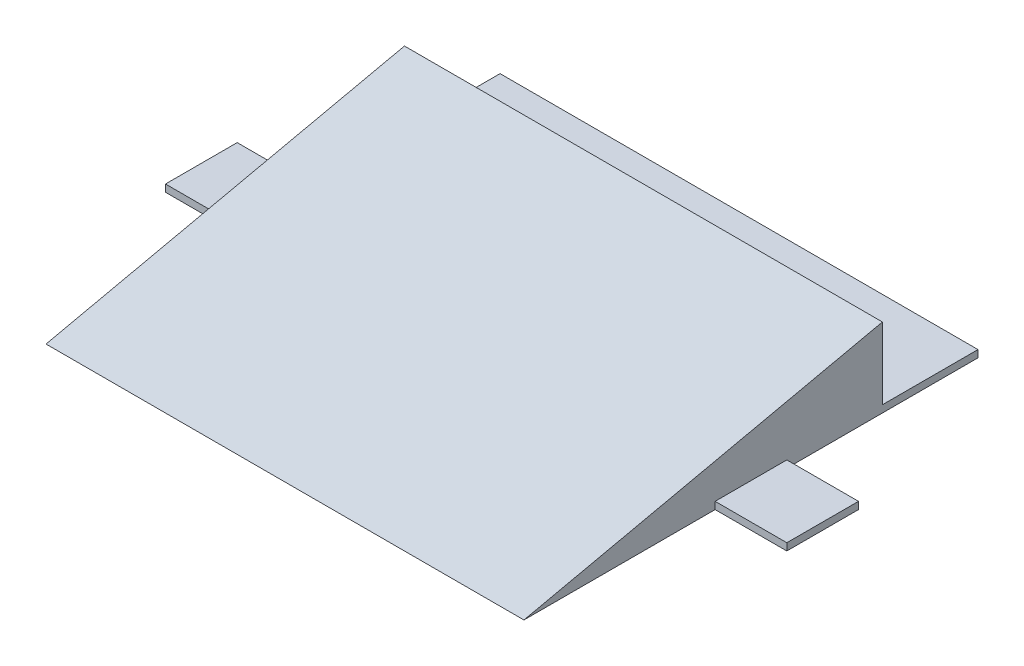
ISO-10303-21;
HEADER;
FILE_DESCRIPTION(('STEP AP214'),'2;1');
FILE_NAME('part.step','',(''),(''),'','','');
FILE_SCHEMA(('AUTOMOTIVE_DESIGN { 1 0 10303 214 1 1 1 1 }'));
ENDSEC;
DATA;
#1=APPLICATION_CONTEXT('core data for automotive mechanical design processes');
#2=APPLICATION_PROTOCOL_DEFINITION('international standard','automotive_design',2000,#1);
#3=PRODUCT_CONTEXT('',#1,'mechanical');
#4=PRODUCT('Part','Part','',(#3));
#5=PRODUCT_RELATED_PRODUCT_CATEGORY('part','',(#4));
#6=PRODUCT_DEFINITION_FORMATION('','',#4);
#7=PRODUCT_DEFINITION_CONTEXT('part definition',#1,'design');
#8=PRODUCT_DEFINITION('design','',#6,#7);
#9=PRODUCT_DEFINITION_SHAPE('','',#8);
#10=(LENGTH_UNIT() NAMED_UNIT(*) SI_UNIT(.MILLI.,.METRE.));
#11=(NAMED_UNIT(*) PLANE_ANGLE_UNIT() SI_UNIT($,.RADIAN.));
#12=(NAMED_UNIT(*) SI_UNIT($,.STERADIAN.) SOLID_ANGLE_UNIT());
#13=UNCERTAINTY_MEASURE_WITH_UNIT(LENGTH_MEASURE(1.E-05),#10,'distance_accuracy_value','');
#14=(GEOMETRIC_REPRESENTATION_CONTEXT(3) GLOBAL_UNCERTAINTY_ASSIGNED_CONTEXT((#13)) GLOBAL_UNIT_ASSIGNED_CONTEXT((#10,
#11,#12)) REPRESENTATION_CONTEXT('',''));
#15=CARTESIAN_POINT('',(0.,0.,0.));
#16=DIRECTION('',(0.,0.,1.));
#17=DIRECTION('',(1.,0.,0.));
#18=AXIS2_PLACEMENT_3D('',#15,#16,#17);
#19=CARTESIAN_POINT('',(-50.,0.,0.));
#20=DIRECTION('',(1.,0.,0.));
#21=DIRECTION('',(0.,0.,-1.));
#22=AXIS2_PLACEMENT_3D('',#19,#20,#21);
#23=PLANE('',#22);
#24=DIRECTION('',(0.,-1.,0.));
#25=VECTOR('',#24,1.);
#26=CARTESIAN_POINT('',(-50.,22.7132034355964,20.));
#27=LINE('',#26,#25);
#28=CARTESIAN_POINT('',(-50.,1.5,20.));
#29=VERTEX_POINT('',#28);
#30=CARTESIAN_POINT('',(-50.,0.,20.));
#31=VERTEX_POINT('',#30);
#32=EDGE_CURVE('E163',#29,#31,#27,.T.);
#33=ORIENTED_EDGE('',*,*,#32,.F.);
#34=DIRECTION('',(0.,0.,1.));
#35=VECTOR('',#34,1.);
#36=CARTESIAN_POINT('',(-50.,1.5,35.));
#37=LINE('',#36,#35);
#38=CARTESIAN_POINT('',(-50.,1.5,35.));
#39=VERTEX_POINT('',#38);
#40=EDGE_CURVE('E145',#29,#39,#37,.T.);
#41=ORIENTED_EDGE('',*,*,#40,.T.);
#42=DIRECTION('',(0.,-1.,0.));
#43=VECTOR('',#42,1.);
#44=CARTESIAN_POINT('',(-50.,22.7132034355964,35.));
#45=LINE('',#44,#43);
#46=CARTESIAN_POINT('',(-50.,0.,35.));
#47=VERTEX_POINT('',#46);
#48=EDGE_CURVE('E154',#39,#47,#45,.T.);
#49=ORIENTED_EDGE('',*,*,#48,.T.);
#50=DIRECTION('',(0.,0.,-1.));
#51=VECTOR('',#50,1.);
#52=CARTESIAN_POINT('',(-50.,0.,0.));
#53=LINE('',#52,#51);
#54=CARTESIAN_POINT('',(-50.,0.,75.));
#55=VERTEX_POINT('',#54);
#56=EDGE_CURVE('E257',#55,#47,#53,.T.);
#57=ORIENTED_EDGE('',*,*,#56,.F.);
#58=DIRECTION('',(0.,-0.21486178267512,0.97664446670509));
#59=VECTOR('',#58,1.);
#60=CARTESIAN_POINT('',(-50.,0.,75.));
#61=LINE('',#60,#59);
#62=CARTESIAN_POINT('',(-50.,16.5,0.));
#63=VERTEX_POINT('',#62);
#64=EDGE_CURVE('E263',#63,#55,#61,.T.);
#65=ORIENTED_EDGE('',*,*,#64,.F.);
#66=DIRECTION('',(0.,1.,0.));
#67=VECTOR('',#66,1.);
#68=CARTESIAN_POINT('',(-50.,16.5,0.));
#69=LINE('',#68,#67);
#70=CARTESIAN_POINT('',(-50.,1.5,0.));
#71=VERTEX_POINT('',#70);
#72=EDGE_CURVE('E260',#71,#63,#69,.T.);
#73=ORIENTED_EDGE('',*,*,#72,.F.);
#74=DIRECTION('',(0.,0.,-1.));
#75=VECTOR('',#74,1.);
#76=CARTESIAN_POINT('',(-50.,1.5,0.));
#77=LINE('',#76,#75);
#78=CARTESIAN_POINT('',(-50.,1.5,-20.));
#79=VERTEX_POINT('',#78);
#80=EDGE_CURVE('E224',#71,#79,#77,.T.);
#81=ORIENTED_EDGE('',*,*,#80,.T.);
#82=DIRECTION('',(0.,-1.,0.));
#83=VECTOR('',#82,1.);
#84=CARTESIAN_POINT('',(-50.,0.,-20.));
#85=LINE('',#84,#83);
#86=CARTESIAN_POINT('',(-50.,0.,-20.));
#87=VERTEX_POINT('',#86);
#88=EDGE_CURVE('E220',#79,#87,#85,.T.);
#89=ORIENTED_EDGE('',*,*,#88,.T.);
#90=EDGE_CURVE('E228',#31,#87,#53,.T.);
#91=ORIENTED_EDGE('',*,*,#90,.F.);
#92=EDGE_LOOP('',(#33,#41,#49,#57,#65,#73,#81,#89,#91));
#93=FACE_BOUND('',#92,.T.);
#94=ADVANCED_FACE('F45',(#93),#23,.F.);
#95=CARTESIAN_POINT('',(50.,16.5,0.));
#96=DIRECTION('',(0.,0.,1.));
#97=DIRECTION('',(1.,0.,0.));
#98=AXIS2_PLACEMENT_3D('',#95,#96,#97);
#99=PLANE('',#98);
#100=DIRECTION('',(1.,0.,0.));
#101=VECTOR('',#100,1.);
#102=CARTESIAN_POINT('',(-70.0561711201316,1.5,0.));
#103=LINE('',#102,#101);
#104=CARTESIAN_POINT('',(50.,1.5,0.));
#105=VERTEX_POINT('',#104);
#106=EDGE_CURVE('E225',#71,#105,#103,.T.);
#107=ORIENTED_EDGE('',*,*,#106,.F.);
#108=ORIENTED_EDGE('',*,*,#72,.T.);
#109=DIRECTION('',(-1.,0.,0.));
#110=VECTOR('',#109,1.);
#111=CARTESIAN_POINT('',(50.,16.5,0.));
#112=LINE('',#111,#110);
#113=CARTESIAN_POINT('',(50.,16.5,0.));
#114=VERTEX_POINT('',#113);
#115=EDGE_CURVE('E11',#114,#63,#112,.T.);
#116=ORIENTED_EDGE('',*,*,#115,.F.);
#117=DIRECTION('',(0.,1.,0.));
#118=VECTOR('',#117,1.);
#119=CARTESIAN_POINT('',(50.,16.5,0.));
#120=LINE('',#119,#118);
#121=EDGE_CURVE('E250',#105,#114,#120,.T.);
#122=ORIENTED_EDGE('',*,*,#121,.F.);
#123=EDGE_LOOP('',(#107,#108,#116,#122));
#124=FACE_BOUND('',#123,.T.);
#125=ADVANCED_FACE('F278',(#124),#99,.F.);
#126=CARTESIAN_POINT('',(50.,0.,0.));
#127=DIRECTION('',(0.,1.,0.));
#128=DIRECTION('',(0.,0.,1.));
#129=AXIS2_PLACEMENT_3D('',#126,#127,#128);
#130=PLANE('',#129);
#131=ORIENTED_EDGE('',*,*,#56,.T.);
#132=DIRECTION('',(-1.,0.,0.));
#133=VECTOR('',#132,1.);
#134=CARTESIAN_POINT('',(-50.,0.,35.));
#135=LINE('',#134,#133);
#136=CARTESIAN_POINT('',(-65.,0.,35.));
#137=VERTEX_POINT('',#136);
#138=EDGE_CURVE('E61',#47,#137,#135,.T.);
#139=ORIENTED_EDGE('',*,*,#138,.T.);
#140=DIRECTION('',(0.,0.,-1.));
#141=VECTOR('',#140,1.);
#142=CARTESIAN_POINT('',(-65.,0.,35.));
#143=LINE('',#142,#141);
#144=CARTESIAN_POINT('',(-65.,0.,20.));
#145=VERTEX_POINT('',#144);
#146=EDGE_CURVE('E174',#137,#145,#143,.T.);
#147=ORIENTED_EDGE('',*,*,#146,.T.);
#148=DIRECTION('',(1.,0.,0.));
#149=VECTOR('',#148,1.);
#150=CARTESIAN_POINT('',(-50.,0.,20.));
#151=LINE('',#150,#149);
#152=EDGE_CURVE('E151',#145,#31,#151,.T.);
#153=ORIENTED_EDGE('',*,*,#152,.T.);
#154=ORIENTED_EDGE('',*,*,#90,.T.);
#155=DIRECTION('',(1.,0.,0.));
#156=VECTOR('',#155,1.);
#157=CARTESIAN_POINT('',(-70.0561711201316,0.,-20.));
#158=LINE('',#157,#156);
#159=CARTESIAN_POINT('',(50.,0.,-20.));
#160=VERTEX_POINT('',#159);
#161=EDGE_CURVE('E236',#87,#160,#158,.T.);
#162=ORIENTED_EDGE('',*,*,#161,.T.);
#163=DIRECTION('',(0.,0.,-1.));
#164=VECTOR('',#163,1.);
#165=CARTESIAN_POINT('',(50.,0.,0.));
#166=LINE('',#165,#164);
#167=CARTESIAN_POINT('',(50.,0.,20.));
#168=VERTEX_POINT('',#167);
#169=EDGE_CURVE('E251',#168,#160,#166,.T.);
#170=ORIENTED_EDGE('',*,*,#169,.F.);
#171=DIRECTION('',(1.,0.,0.));
#172=VECTOR('',#171,1.);
#173=CARTESIAN_POINT('',(50.,0.,20.));
#174=LINE('',#173,#172);
#175=CARTESIAN_POINT('',(65.,0.,20.));
#176=VERTEX_POINT('',#175);
#177=EDGE_CURVE('E69',#168,#176,#174,.T.);
#178=ORIENTED_EDGE('',*,*,#177,.T.);
#179=DIRECTION('',(0.,0.,1.));
#180=VECTOR('',#179,1.);
#181=CARTESIAN_POINT('',(65.,0.,35.));
#182=LINE('',#181,#180);
#183=CARTESIAN_POINT('',(65.,0.,35.));
#184=VERTEX_POINT('',#183);
#185=EDGE_CURVE('E186',#176,#184,#182,.T.);
#186=ORIENTED_EDGE('',*,*,#185,.T.);
#187=DIRECTION('',(-1.,0.,0.));
#188=VECTOR('',#187,1.);
#189=CARTESIAN_POINT('',(50.,0.,35.));
#190=LINE('',#189,#188);
#191=CARTESIAN_POINT('',(50.,0.,35.));
#192=VERTEX_POINT('',#191);
#193=EDGE_CURVE('E181',#184,#192,#190,.T.);
#194=ORIENTED_EDGE('',*,*,#193,.T.);
#195=CARTESIAN_POINT('',(50.,0.,75.));
#196=VERTEX_POINT('',#195);
#197=EDGE_CURVE('E246',#196,#192,#166,.T.);
#198=ORIENTED_EDGE('',*,*,#197,.F.);
#199=DIRECTION('',(-1.,0.,0.));
#200=VECTOR('',#199,1.);
#201=CARTESIAN_POINT('',(50.,0.,75.));
#202=LINE('',#201,#200);
#203=EDGE_CURVE('E54',#196,#55,#202,.T.);
#204=ORIENTED_EDGE('',*,*,#203,.T.);
#205=EDGE_LOOP('',(#131,#139,#147,#153,#154,#162,#170,#178,#186,#194,#198,#204));
#206=FACE_BOUND('',#205,.T.);
#207=ADVANCED_FACE('F47',(#206),#130,.F.);
#208=CARTESIAN_POINT('',(50.,0.,75.));
#209=DIRECTION('',(0.,-0.97664446670509,-0.21486178267512));
#210=DIRECTION('',(0.,0.21486178267512,-0.97664446670509));
#211=AXIS2_PLACEMENT_3D('',#208,#209,#210);
#212=PLANE('',#211);
#213=ORIENTED_EDGE('',*,*,#64,.T.);
#214=ORIENTED_EDGE('',*,*,#203,.F.);
#215=DIRECTION('',(0.,-0.21486178267512,0.97664446670509));
#216=VECTOR('',#215,1.);
#217=CARTESIAN_POINT('',(50.,0.,75.));
#218=LINE('',#217,#216);
#219=EDGE_CURVE('E254',#114,#196,#218,.T.);
#220=ORIENTED_EDGE('',*,*,#219,.F.);
#221=ORIENTED_EDGE('',*,*,#115,.T.);
#222=EDGE_LOOP('',(#213,#214,#220,#221));
#223=FACE_BOUND('',#222,.T.);
#224=ADVANCED_FACE('F275',(#223),#212,.F.);
#225=CARTESIAN_POINT('',(50.,0.,0.));
#226=DIRECTION('',(1.,0.,0.));
#227=DIRECTION('',(0.,0.,-1.));
#228=AXIS2_PLACEMENT_3D('',#225,#226,#227);
#229=PLANE('',#228);
#230=DIRECTION('',(0.,-1.,0.));
#231=VECTOR('',#230,1.);
#232=CARTESIAN_POINT('',(50.,22.7132034355964,35.));
#233=LINE('',#232,#231);
#234=CARTESIAN_POINT('',(50.,1.5,35.));
#235=VERTEX_POINT('',#234);
#236=EDGE_CURVE('E201',#235,#192,#233,.T.);
#237=ORIENTED_EDGE('',*,*,#236,.F.);
#238=DIRECTION('',(0.,0.,-1.));
#239=VECTOR('',#238,1.);
#240=CARTESIAN_POINT('',(50.,1.5,35.));
#241=LINE('',#240,#239);
#242=CARTESIAN_POINT('',(50.,1.5,20.));
#243=VERTEX_POINT('',#242);
#244=EDGE_CURVE('E196',#235,#243,#241,.T.);
#245=ORIENTED_EDGE('',*,*,#244,.T.);
#246=DIRECTION('',(0.,-1.,0.));
#247=VECTOR('',#246,1.);
#248=CARTESIAN_POINT('',(50.,22.7132034355964,20.));
#249=LINE('',#248,#247);
#250=EDGE_CURVE('E200',#243,#168,#249,.T.);
#251=ORIENTED_EDGE('',*,*,#250,.T.);
#252=ORIENTED_EDGE('',*,*,#169,.T.);
#253=DIRECTION('',(0.,1.,0.));
#254=VECTOR('',#253,1.);
#255=CARTESIAN_POINT('',(50.,0.,-20.));
#256=LINE('',#255,#254);
#257=CARTESIAN_POINT('',(50.,1.5,-20.));
#258=VERTEX_POINT('',#257);
#259=EDGE_CURVE('E219',#160,#258,#256,.T.);
#260=ORIENTED_EDGE('',*,*,#259,.T.);
#261=DIRECTION('',(0.,0.,1.));
#262=VECTOR('',#261,1.);
#263=CARTESIAN_POINT('',(50.,1.5,0.));
#264=LINE('',#263,#262);
#265=EDGE_CURVE('E232',#258,#105,#264,.T.);
#266=ORIENTED_EDGE('',*,*,#265,.T.);
#267=ORIENTED_EDGE('',*,*,#121,.T.);
#268=ORIENTED_EDGE('',*,*,#219,.T.);
#269=ORIENTED_EDGE('',*,*,#197,.T.);
#270=EDGE_LOOP('',(#237,#245,#251,#252,#260,#266,#267,#268,#269));
#271=FACE_BOUND('',#270,.T.);
#272=ADVANCED_FACE('F285',(#271),#229,.T.);
#273=CARTESIAN_POINT('',(-70.0561711201316,1.5,0.));
#274=DIRECTION('',(0.,1.,0.));
#275=DIRECTION('',(0.,0.,1.));
#276=AXIS2_PLACEMENT_3D('',#273,#274,#275);
#277=PLANE('',#276);
#278=ORIENTED_EDGE('',*,*,#80,.F.);
#279=ORIENTED_EDGE('',*,*,#106,.T.);
#280=ORIENTED_EDGE('',*,*,#265,.F.);
#281=DIRECTION('',(1.,0.,0.));
#282=VECTOR('',#281,1.);
#283=CARTESIAN_POINT('',(-70.0561711201316,1.5,-20.));
#284=LINE('',#283,#282);
#285=EDGE_CURVE('E240',#79,#258,#284,.T.);
#286=ORIENTED_EDGE('',*,*,#285,.F.);
#287=EDGE_LOOP('',(#278,#279,#280,#286));
#288=FACE_BOUND('',#287,.T.);
#289=ADVANCED_FACE('F281',(#288),#277,.T.);
#290=CARTESIAN_POINT('',(-70.0561711201316,0.,-20.));
#291=DIRECTION('',(0.,0.,-1.));
#292=DIRECTION('',(-1.,0.,0.));
#293=AXIS2_PLACEMENT_3D('',#290,#291,#292);
#294=PLANE('',#293);
#295=ORIENTED_EDGE('',*,*,#88,.F.);
#296=ORIENTED_EDGE('',*,*,#285,.T.);
#297=ORIENTED_EDGE('',*,*,#259,.F.);
#298=ORIENTED_EDGE('',*,*,#161,.F.);
#299=EDGE_LOOP('',(#295,#296,#297,#298));
#300=FACE_BOUND('',#299,.T.);
#301=ADVANCED_FACE('F291',(#300),#294,.T.);
#302=CARTESIAN_POINT('',(-70.0561711201316,1.5,0.));
#303=DIRECTION('',(0.,1.,0.));
#304=DIRECTION('',(0.,0.,1.));
#305=AXIS2_PLACEMENT_3D('',#302,#303,#304);
#306=PLANE('',#305);
#307=ORIENTED_EDGE('',*,*,#244,.F.);
#308=DIRECTION('',(-1.,0.,0.));
#309=VECTOR('',#308,1.);
#310=CARTESIAN_POINT('',(50.,1.5,35.));
#311=LINE('',#310,#309);
#312=CARTESIAN_POINT('',(65.,1.5,35.));
#313=VERTEX_POINT('',#312);
#314=EDGE_CURVE('E202',#313,#235,#311,.T.);
#315=ORIENTED_EDGE('',*,*,#314,.F.);
#316=DIRECTION('',(0.,0.,1.));
#317=VECTOR('',#316,1.);
#318=CARTESIAN_POINT('',(65.,1.5,35.));
#319=LINE('',#318,#317);
#320=CARTESIAN_POINT('',(65.,1.5,20.));
#321=VERTEX_POINT('',#320);
#322=EDGE_CURVE('E207',#321,#313,#319,.T.);
#323=ORIENTED_EDGE('',*,*,#322,.F.);
#324=DIRECTION('',(1.,0.,0.));
#325=VECTOR('',#324,1.);
#326=CARTESIAN_POINT('',(50.,1.5,20.));
#327=LINE('',#326,#325);
#328=EDGE_CURVE('E185',#243,#321,#327,.T.);
#329=ORIENTED_EDGE('',*,*,#328,.F.);
#330=EDGE_LOOP('',(#307,#315,#323,#329));
#331=FACE_BOUND('',#330,.T.);
#332=ADVANCED_FACE('F343',(#331),#306,.T.);
#333=CARTESIAN_POINT('',(50.,22.7132034355964,20.));
#334=DIRECTION('',(0.,0.,-1.));
#335=DIRECTION('',(0.,1.,0.));
#336=AXIS2_PLACEMENT_3D('',#333,#334,#335);
#337=PLANE('',#336);
#338=ORIENTED_EDGE('',*,*,#250,.F.);
#339=ORIENTED_EDGE('',*,*,#328,.T.);
#340=DIRECTION('',(0.,-1.,0.));
#341=VECTOR('',#340,1.);
#342=CARTESIAN_POINT('',(65.,22.7132034355964,20.));
#343=LINE('',#342,#341);
#344=EDGE_CURVE('E195',#321,#176,#343,.T.);
#345=ORIENTED_EDGE('',*,*,#344,.T.);
#346=ORIENTED_EDGE('',*,*,#177,.F.);
#347=EDGE_LOOP('',(#338,#339,#345,#346));
#348=FACE_BOUND('',#347,.T.);
#349=ADVANCED_FACE('F346',(#348),#337,.T.);
#350=CARTESIAN_POINT('',(65.,22.7132034355964,35.));
#351=DIRECTION('',(1.,0.,0.));
#352=DIRECTION('',(0.,0.,-1.));
#353=AXIS2_PLACEMENT_3D('',#350,#351,#352);
#354=PLANE('',#353);
#355=ORIENTED_EDGE('',*,*,#344,.F.);
#356=ORIENTED_EDGE('',*,*,#322,.T.);
#357=DIRECTION('',(0.,-1.,0.));
#358=VECTOR('',#357,1.);
#359=CARTESIAN_POINT('',(65.,22.7132034355964,35.));
#360=LINE('',#359,#358);
#361=EDGE_CURVE('E206',#313,#184,#360,.T.);
#362=ORIENTED_EDGE('',*,*,#361,.T.);
#363=ORIENTED_EDGE('',*,*,#185,.F.);
#364=EDGE_LOOP('',(#355,#356,#362,#363));
#365=FACE_BOUND('',#364,.T.);
#366=ADVANCED_FACE('F355',(#365),#354,.T.);
#367=CARTESIAN_POINT('',(50.,22.7132034355964,35.));
#368=DIRECTION('',(0.,0.,1.));
#369=DIRECTION('',(1.,0.,0.));
#370=AXIS2_PLACEMENT_3D('',#367,#368,#369);
#371=PLANE('',#370);
#372=ORIENTED_EDGE('',*,*,#361,.F.);
#373=ORIENTED_EDGE('',*,*,#314,.T.);
#374=ORIENTED_EDGE('',*,*,#236,.T.);
#375=ORIENTED_EDGE('',*,*,#193,.F.);
#376=EDGE_LOOP('',(#372,#373,#374,#375));
#377=FACE_BOUND('',#376,.T.);
#378=ADVANCED_FACE('F363',(#377),#371,.T.);
#379=CARTESIAN_POINT('',(-70.0561711201316,1.5,0.));
#380=DIRECTION('',(0.,1.,0.));
#381=DIRECTION('',(0.,0.,1.));
#382=AXIS2_PLACEMENT_3D('',#379,#380,#381);
#383=PLANE('',#382);
#384=ORIENTED_EDGE('',*,*,#40,.F.);
#385=DIRECTION('',(1.,0.,0.));
#386=VECTOR('',#385,1.);
#387=CARTESIAN_POINT('',(-50.,1.5,20.));
#388=LINE('',#387,#386);
#389=CARTESIAN_POINT('',(-65.,1.5,20.));
#390=VERTEX_POINT('',#389);
#391=EDGE_CURVE('E167',#390,#29,#388,.T.);
#392=ORIENTED_EDGE('',*,*,#391,.F.);
#393=DIRECTION('',(0.,0.,-1.));
#394=VECTOR('',#393,1.);
#395=CARTESIAN_POINT('',(-65.,1.5,35.));
#396=LINE('',#395,#394);
#397=CARTESIAN_POINT('',(-65.,1.5,35.));
#398=VERTEX_POINT('',#397);
#399=EDGE_CURVE('E148',#398,#390,#396,.T.);
#400=ORIENTED_EDGE('',*,*,#399,.F.);
#401=DIRECTION('',(-1.,0.,0.));
#402=VECTOR('',#401,1.);
#403=CARTESIAN_POINT('',(-50.,1.5,35.));
#404=LINE('',#403,#402);
#405=EDGE_CURVE('E142',#39,#398,#404,.T.);
#406=ORIENTED_EDGE('',*,*,#405,.F.);
#407=EDGE_LOOP('',(#384,#392,#400,#406));
#408=FACE_BOUND('',#407,.T.);
#409=ADVANCED_FACE('F143',(#408),#383,.T.);
#410=CARTESIAN_POINT('',(-50.,22.7132034355964,35.));
#411=DIRECTION('',(0.,0.,1.));
#412=DIRECTION('',(1.,0.,0.));
#413=AXIS2_PLACEMENT_3D('',#410,#411,#412);
#414=PLANE('',#413);
#415=ORIENTED_EDGE('',*,*,#48,.F.);
#416=ORIENTED_EDGE('',*,*,#405,.T.);
#417=DIRECTION('',(0.,-1.,0.));
#418=VECTOR('',#417,1.);
#419=CARTESIAN_POINT('',(-65.,22.7132034355964,35.));
#420=LINE('',#419,#418);
#421=EDGE_CURVE('E152',#398,#137,#420,.T.);
#422=ORIENTED_EDGE('',*,*,#421,.T.);
#423=ORIENTED_EDGE('',*,*,#138,.F.);
#424=EDGE_LOOP('',(#415,#416,#422,#423));
#425=FACE_BOUND('',#424,.T.);
#426=ADVANCED_FACE('F155',(#425),#414,.T.);
#427=CARTESIAN_POINT('',(-65.,22.7132034355964,35.));
#428=DIRECTION('',(-1.,0.,0.));
#429=DIRECTION('',(0.,0.,1.));
#430=AXIS2_PLACEMENT_3D('',#427,#428,#429);
#431=PLANE('',#430);
#432=ORIENTED_EDGE('',*,*,#421,.F.);
#433=ORIENTED_EDGE('',*,*,#399,.T.);
#434=DIRECTION('',(0.,-1.,0.));
#435=VECTOR('',#434,1.);
#436=CARTESIAN_POINT('',(-65.,22.7132034355964,20.));
#437=LINE('',#436,#435);
#438=EDGE_CURVE('E297',#390,#145,#437,.T.);
#439=ORIENTED_EDGE('',*,*,#438,.T.);
#440=ORIENTED_EDGE('',*,*,#146,.F.);
#441=EDGE_LOOP('',(#432,#433,#439,#440));
#442=FACE_BOUND('',#441,.T.);
#443=ADVANCED_FACE('F306',(#442),#431,.T.);
#444=CARTESIAN_POINT('',(-50.,22.7132034355964,20.));
#445=DIRECTION('',(0.,0.,-1.));
#446=DIRECTION('',(0.,1.,0.));
#447=AXIS2_PLACEMENT_3D('',#444,#445,#446);
#448=PLANE('',#447);
#449=ORIENTED_EDGE('',*,*,#438,.F.);
#450=ORIENTED_EDGE('',*,*,#391,.T.);
#451=ORIENTED_EDGE('',*,*,#32,.T.);
#452=ORIENTED_EDGE('',*,*,#152,.F.);
#453=EDGE_LOOP('',(#449,#450,#451,#452));
#454=FACE_BOUND('',#453,.T.);
#455=ADVANCED_FACE('F302',(#454),#448,.T.);
#456=CLOSED_SHELL('',(#94,#125,#207,#224,#272,#289,#301,#332,#349,#366,#378,#409,#426,#443,#455));
#457=MANIFOLD_SOLID_BREP('B2',#456);
#458=ADVANCED_BREP_SHAPE_REPRESENTATION('',(#18,#457),#14);
#459=SHAPE_DEFINITION_REPRESENTATION(#9,#458);
ENDSEC;
END-ISO-10303-21;
